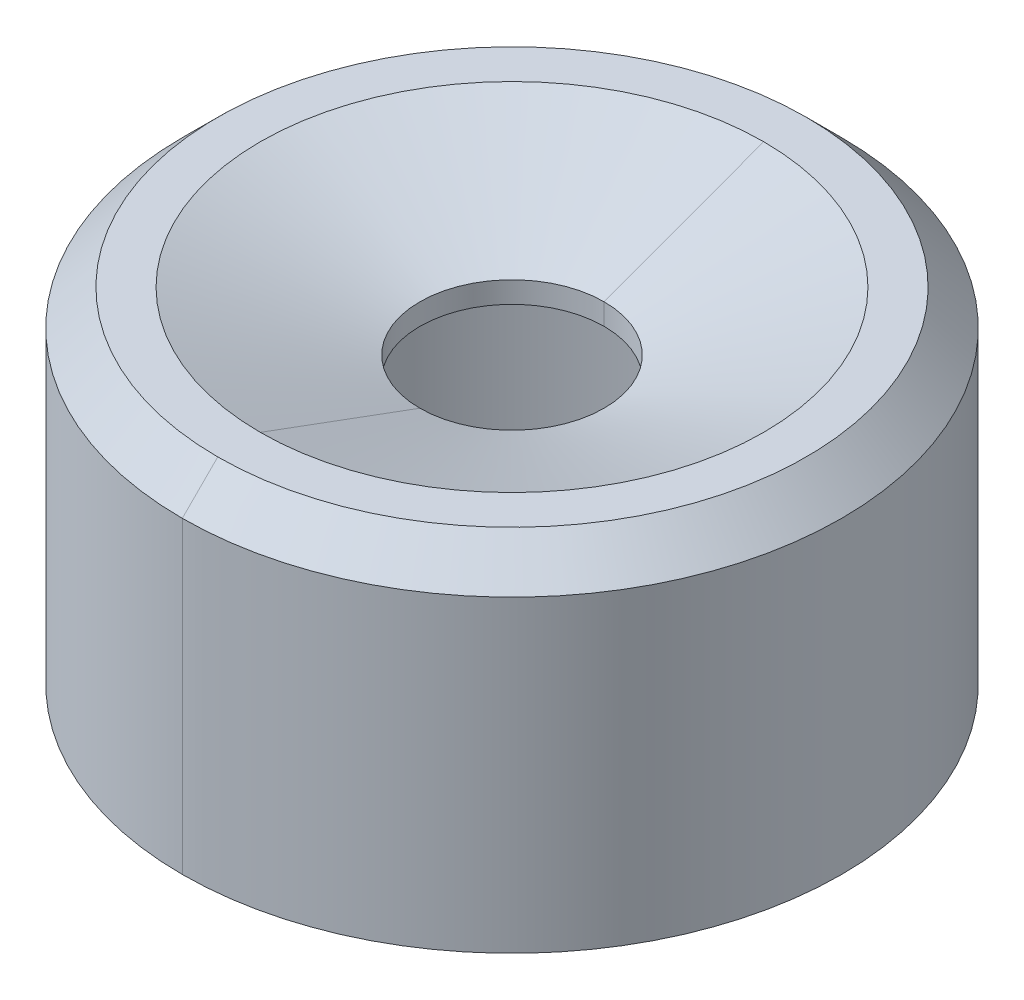
ISO-10303-21;
HEADER;
FILE_DESCRIPTION(('STEP AP214'),'2;1');
FILE_NAME('part.step','',(''),(''),'','','');
FILE_SCHEMA(('AUTOMOTIVE_DESIGN { 1 0 10303 214 1 1 1 1 }'));
ENDSEC;
DATA;
#1=APPLICATION_CONTEXT('core data for automotive mechanical design processes');
#2=APPLICATION_PROTOCOL_DEFINITION('international standard','automotive_design',2000,#1);
#3=PRODUCT_CONTEXT('',#1,'mechanical');
#4=PRODUCT('Part','Part','',(#3));
#5=PRODUCT_RELATED_PRODUCT_CATEGORY('part','',(#4));
#6=PRODUCT_DEFINITION_FORMATION('','',#4);
#7=PRODUCT_DEFINITION_CONTEXT('part definition',#1,'design');
#8=PRODUCT_DEFINITION('design','',#6,#7);
#9=PRODUCT_DEFINITION_SHAPE('','',#8);
#10=(LENGTH_UNIT() NAMED_UNIT(*) SI_UNIT(.MILLI.,.METRE.));
#11=(NAMED_UNIT(*) PLANE_ANGLE_UNIT() SI_UNIT($,.RADIAN.));
#12=(NAMED_UNIT(*) SI_UNIT($,.STERADIAN.) SOLID_ANGLE_UNIT());
#13=UNCERTAINTY_MEASURE_WITH_UNIT(LENGTH_MEASURE(1.E-05),#10,'distance_accuracy_value','');
#14=(GEOMETRIC_REPRESENTATION_CONTEXT(3) GLOBAL_UNCERTAINTY_ASSIGNED_CONTEXT((#13)) GLOBAL_UNIT_ASSIGNED_CONTEXT((#10,
#11,#12)) REPRESENTATION_CONTEXT('',''));
#15=CARTESIAN_POINT('',(0.,0.,0.));
#16=DIRECTION('',(0.,0.,1.));
#17=DIRECTION('',(1.,0.,0.));
#18=AXIS2_PLACEMENT_3D('',#15,#16,#17);
#19=CARTESIAN_POINT('',(0.,48.18107344633,0.));
#20=DIRECTION('',(0.,1.,0.));
#21=DIRECTION('',(0.,0.,1.));
#22=AXIS2_PLACEMENT_3D('',#19,#20,#21);
#23=CYLINDRICAL_SURFACE('',#22,1.3);
#24=CARTESIAN_POINT('',(0.,3.72,0.));
#25=DIRECTION('',(0.,1.,0.));
#26=DIRECTION('',(0.,0.,1.));
#27=AXIS2_PLACEMENT_3D('',#24,#25,#26);
#28=CIRCLE('',#27,1.3);
#29=CARTESIAN_POINT('',(0.,3.72,1.3));
#30=VERTEX_POINT('',#29);
#31=CARTESIAN_POINT('',(0.,3.72,-1.3));
#32=VERTEX_POINT('',#31);
#33=EDGE_CURVE('E194',#30,#32,#28,.T.);
#34=ORIENTED_EDGE('',*,*,#33,.F.);
#35=DIRECTION('',(0.,-1.,0.));
#36=VECTOR('',#35,1.);
#37=CARTESIAN_POINT('',(0.,4.02,1.3));
#38=LINE('',#37,#36);
#39=CARTESIAN_POINT('',(0.,4.02,1.3));
#40=VERTEX_POINT('',#39);
#41=EDGE_CURVE('E177',#40,#30,#38,.T.);
#42=ORIENTED_EDGE('',*,*,#41,.F.);
#43=CARTESIAN_POINT('',(0.,4.02,0.));
#44=DIRECTION('',(0.,-1.,0.));
#45=DIRECTION('',(0.,0.,-1.));
#46=AXIS2_PLACEMENT_3D('',#43,#44,#45);
#47=CIRCLE('',#46,1.3);
#48=CARTESIAN_POINT('',(0.,4.02,-1.3));
#49=VERTEX_POINT('',#48);
#50=EDGE_CURVE('E147',#49,#40,#47,.T.);
#51=ORIENTED_EDGE('',*,*,#50,.F.);
#52=DIRECTION('',(0.,-1.,0.));
#53=VECTOR('',#52,1.);
#54=CARTESIAN_POINT('',(0.,4.02,-1.3));
#55=LINE('',#54,#53);
#56=EDGE_CURVE('E173',#49,#32,#55,.T.);
#57=ORIENTED_EDGE('',*,*,#56,.T.);
#58=EDGE_LOOP('',(#34,#42,#51,#57));
#59=FACE_BOUND('',#58,.T.);
#60=ADVANCED_FACE('F15',(#59),#23,.F.);
#61=CARTESIAN_POINT('',(0.,48.18107344633,0.));
#62=DIRECTION('',(0.,1.,0.));
#63=DIRECTION('',(0.,0.,1.));
#64=AXIS2_PLACEMENT_3D('',#61,#62,#63);
#65=CYLINDRICAL_SURFACE('',#64,4.145);
#66=CARTESIAN_POINT('',(0.,0.,0.));
#67=DIRECTION('',(0.,1.,0.));
#68=DIRECTION('',(0.,0.,1.));
#69=AXIS2_PLACEMENT_3D('',#66,#67,#68);
#70=CIRCLE('',#69,4.145);
#71=CARTESIAN_POINT('',(0.,0.,4.145));
#72=VERTEX_POINT('',#71);
#73=CARTESIAN_POINT('',(0.,0.,-4.145));
#74=VERTEX_POINT('',#73);
#75=EDGE_CURVE('E112',#72,#74,#70,.T.);
#76=ORIENTED_EDGE('',*,*,#75,.F.);
#77=DIRECTION('',(0.,-1.,0.));
#78=VECTOR('',#77,1.);
#79=CARTESIAN_POINT('',(0.,3.1,4.145));
#80=LINE('',#79,#78);
#81=CARTESIAN_POINT('',(0.,3.1,4.145));
#82=VERTEX_POINT('',#81);
#83=EDGE_CURVE('E116',#82,#72,#80,.T.);
#84=ORIENTED_EDGE('',*,*,#83,.F.);
#85=CARTESIAN_POINT('',(0.,3.1,0.));
#86=DIRECTION('',(0.,-1.,0.));
#87=DIRECTION('',(0.,0.,-1.));
#88=AXIS2_PLACEMENT_3D('',#85,#86,#87);
#89=CIRCLE('',#88,4.145);
#90=CARTESIAN_POINT('',(0.,3.1,-4.145));
#91=VERTEX_POINT('',#90);
#92=EDGE_CURVE('E10',#91,#82,#89,.T.);
#93=ORIENTED_EDGE('',*,*,#92,.F.);
#94=DIRECTION('',(0.,-1.,0.));
#95=VECTOR('',#94,1.);
#96=CARTESIAN_POINT('',(0.,3.1,-4.145));
#97=LINE('',#96,#95);
#98=EDGE_CURVE('E119',#91,#74,#97,.T.);
#99=ORIENTED_EDGE('',*,*,#98,.T.);
#100=EDGE_LOOP('',(#76,#84,#93,#99));
#101=FACE_BOUND('',#100,.T.);
#102=ADVANCED_FACE('F114',(#101),#65,.F.);
#103=CARTESIAN_POINT('',(0.,3.1,0.));
#104=DIRECTION('',(0.,1.,0.));
#105=DIRECTION('',(1.,0.,0.));
#106=AXIS2_PLACEMENT_3D('',#103,#104,#105);
#107=PLANE('',#106);
#108=CARTESIAN_POINT('',(0.,3.1,0.));
#109=DIRECTION('',(0.,1.,0.));
#110=DIRECTION('',(0.,0.,-1.));
#111=AXIS2_PLACEMENT_3D('',#108,#109,#110);
#112=CIRCLE('',#111,3.075);
#113=CARTESIAN_POINT('',(0.,3.1,-3.075));
#114=VERTEX_POINT('',#113);
#115=CARTESIAN_POINT('',(0.,3.1,3.075));
#116=VERTEX_POINT('',#115);
#117=EDGE_CURVE('E26',#114,#116,#112,.T.);
#118=ORIENTED_EDGE('',*,*,#117,.T.);
#119=CARTESIAN_POINT('',(0.,3.1,0.));
#120=DIRECTION('',(0.,1.,0.));
#121=DIRECTION('',(0.,0.,1.));
#122=AXIS2_PLACEMENT_3D('',#119,#120,#121);
#123=CIRCLE('',#122,3.075);
#124=EDGE_CURVE('E196',#116,#114,#123,.T.);
#125=ORIENTED_EDGE('',*,*,#124,.T.);
#126=EDGE_LOOP('',(#118,#125));
#127=FACE_BOUND('',#126,.T.);
#128=CARTESIAN_POINT('',(0.,3.1,0.));
#129=DIRECTION('',(0.,-1.,0.));
#130=DIRECTION('',(0.,0.,1.));
#131=AXIS2_PLACEMENT_3D('',#128,#129,#130);
#132=CIRCLE('',#131,4.145);
#133=EDGE_CURVE('E135',#82,#91,#132,.T.);
#134=ORIENTED_EDGE('',*,*,#133,.T.);
#135=ORIENTED_EDGE('',*,*,#92,.T.);
#136=EDGE_LOOP('',(#134,#135));
#137=FACE_BOUND('',#136,.T.);
#138=ADVANCED_FACE('F17',(#127,#137),#107,.F.);
#139=CARTESIAN_POINT('',(0.,48.18107344633,0.));
#140=DIRECTION('',(0.,1.,0.));
#141=DIRECTION('',(0.,0.,1.));
#142=AXIS2_PLACEMENT_3D('',#139,#140,#141);
#143=CYLINDRICAL_SURFACE('',#142,3.075);
#144=DIRECTION('',(0.,-1.,0.));
#145=VECTOR('',#144,1.);
#146=CARTESIAN_POINT('',(0.,3.72,-3.075));
#147=LINE('',#146,#145);
#148=CARTESIAN_POINT('',(0.,3.72,-3.075));
#149=VERTEX_POINT('',#148);
#150=EDGE_CURVE('E181',#149,#114,#147,.T.);
#151=ORIENTED_EDGE('',*,*,#150,.F.);
#152=CARTESIAN_POINT('',(0.,3.72,0.));
#153=DIRECTION('',(0.,-1.,0.));
#154=DIRECTION('',(0.,0.,1.));
#155=AXIS2_PLACEMENT_3D('',#152,#153,#154);
#156=CIRCLE('',#155,3.075);
#157=CARTESIAN_POINT('',(0.,3.72,3.075));
#158=VERTEX_POINT('',#157);
#159=EDGE_CURVE('E160',#158,#149,#156,.T.);
#160=ORIENTED_EDGE('',*,*,#159,.F.);
#161=DIRECTION('',(0.,-1.,0.));
#162=VECTOR('',#161,1.);
#163=CARTESIAN_POINT('',(0.,3.72,3.075));
#164=LINE('',#163,#162);
#165=EDGE_CURVE('E189',#158,#116,#164,.T.);
#166=ORIENTED_EDGE('',*,*,#165,.T.);
#167=ORIENTED_EDGE('',*,*,#117,.F.);
#168=EDGE_LOOP('',(#151,#160,#166,#167));
#169=FACE_BOUND('',#168,.T.);
#170=ADVANCED_FACE('F218',(#169),#143,.F.);
#171=CARTESIAN_POINT('',(0.,48.18107344633,0.));
#172=DIRECTION('',(0.,1.,0.));
#173=DIRECTION('',(0.,0.,1.));
#174=AXIS2_PLACEMENT_3D('',#171,#172,#173);
#175=CYLINDRICAL_SURFACE('',#174,3.075);
#176=ORIENTED_EDGE('',*,*,#124,.F.);
#177=ORIENTED_EDGE('',*,*,#165,.F.);
#178=CARTESIAN_POINT('',(0.,3.72,0.));
#179=DIRECTION('',(0.,-1.,0.));
#180=DIRECTION('',(0.,0.,-1.));
#181=AXIS2_PLACEMENT_3D('',#178,#179,#180);
#182=CIRCLE('',#181,3.075);
#183=EDGE_CURVE('E164',#149,#158,#182,.T.);
#184=ORIENTED_EDGE('',*,*,#183,.F.);
#185=ORIENTED_EDGE('',*,*,#150,.T.);
#186=EDGE_LOOP('',(#176,#177,#184,#185));
#187=FACE_BOUND('',#186,.T.);
#188=ADVANCED_FACE('F213',(#187),#175,.F.);
#189=CARTESIAN_POINT('',(0.,3.72,0.));
#190=DIRECTION('',(0.,1.,0.));
#191=DIRECTION('',(1.,0.,0.));
#192=AXIS2_PLACEMENT_3D('',#189,#190,#191);
#193=PLANE('',#192);
#194=CARTESIAN_POINT('',(0.,3.72,0.));
#195=DIRECTION('',(0.,1.,0.));
#196=DIRECTION('',(0.,0.,-1.));
#197=AXIS2_PLACEMENT_3D('',#194,#195,#196);
#198=CIRCLE('',#197,1.3);
#199=EDGE_CURVE('E165',#32,#30,#198,.T.);
#200=ORIENTED_EDGE('',*,*,#199,.T.);
#201=ORIENTED_EDGE('',*,*,#33,.T.);
#202=EDGE_LOOP('',(#200,#201));
#203=FACE_BOUND('',#202,.T.);
#204=ORIENTED_EDGE('',*,*,#159,.T.);
#205=ORIENTED_EDGE('',*,*,#183,.T.);
#206=EDGE_LOOP('',(#204,#205));
#207=FACE_BOUND('',#206,.T.);
#208=ADVANCED_FACE('F210',(#203,#207),#193,.F.);
#209=CARTESIAN_POINT('',(0.,48.18107344633,0.));
#210=DIRECTION('',(0.,1.,0.));
#211=DIRECTION('',(0.,0.,1.));
#212=AXIS2_PLACEMENT_3D('',#209,#210,#211);
#213=CYLINDRICAL_SURFACE('',#212,1.3);
#214=ORIENTED_EDGE('',*,*,#56,.F.);
#215=CARTESIAN_POINT('',(0.,4.02,0.));
#216=DIRECTION('',(0.,-1.,0.));
#217=DIRECTION('',(0.,0.,1.));
#218=AXIS2_PLACEMENT_3D('',#215,#216,#217);
#219=CIRCLE('',#218,1.3);
#220=EDGE_CURVE('E178',#40,#49,#219,.T.);
#221=ORIENTED_EDGE('',*,*,#220,.F.);
#222=ORIENTED_EDGE('',*,*,#41,.T.);
#223=ORIENTED_EDGE('',*,*,#199,.F.);
#224=EDGE_LOOP('',(#214,#221,#222,#223));
#225=FACE_BOUND('',#224,.T.);
#226=ADVANCED_FACE('F204',(#225),#213,.F.);
#227=CARTESIAN_POINT('',(0.,4.435,0.));
#228=DIRECTION('',(0.,1.,0.));
#229=DIRECTION('',(0.,0.,1.));
#230=AXIS2_PLACEMENT_3D('',#227,#228,#229);
#231=CONICAL_SURFACE('',#230,2.425,1.21739407737651);
#232=DIRECTION('',(0.,-0.346091796984605,0.938200654476412));
#233=VECTOR('',#232,1.);
#234=CARTESIAN_POINT('',(0.,4.85,-3.55));
#235=LINE('',#234,#233);
#236=CARTESIAN_POINT('',(0.,4.85,-3.55));
#237=VERTEX_POINT('',#236);
#238=EDGE_CURVE('E243',#237,#49,#235,.T.);
#239=ORIENTED_EDGE('',*,*,#238,.F.);
#240=CARTESIAN_POINT('',(0.,4.85,0.));
#241=DIRECTION('',(0.,-1.,0.));
#242=DIRECTION('',(0.,0.,1.));
#243=AXIS2_PLACEMENT_3D('',#240,#241,#242);
#244=CIRCLE('',#243,3.55);
#245=CARTESIAN_POINT('',(0.,4.85,3.55));
#246=VERTEX_POINT('',#245);
#247=EDGE_CURVE('E19',#246,#237,#244,.T.);
#248=ORIENTED_EDGE('',*,*,#247,.F.);
#249=DIRECTION('',(0.,-0.346091796984605,-0.938200654476412));
#250=VECTOR('',#249,1.);
#251=CARTESIAN_POINT('',(0.,4.85,3.55));
#252=LINE('',#251,#250);
#253=EDGE_CURVE('E151',#246,#40,#252,.T.);
#254=ORIENTED_EDGE('',*,*,#253,.T.);
#255=ORIENTED_EDGE('',*,*,#220,.T.);
#256=EDGE_LOOP('',(#239,#248,#254,#255));
#257=FACE_BOUND('',#256,.T.);
#258=ADVANCED_FACE('F273',(#257),#231,.F.);
#259=CARTESIAN_POINT('',(0.,4.435,0.));
#260=DIRECTION('',(0.,1.,0.));
#261=DIRECTION('',(0.,0.,1.));
#262=AXIS2_PLACEMENT_3D('',#259,#260,#261);
#263=CONICAL_SURFACE('',#262,2.425,1.21739407737651);
#264=ORIENTED_EDGE('',*,*,#50,.T.);
#265=ORIENTED_EDGE('',*,*,#253,.F.);
#266=CARTESIAN_POINT('',(0.,4.85,0.));
#267=DIRECTION('',(0.,-1.,0.));
#268=DIRECTION('',(0.,0.,-1.));
#269=AXIS2_PLACEMENT_3D('',#266,#267,#268);
#270=CIRCLE('',#269,3.55);
#271=EDGE_CURVE('E152',#237,#246,#270,.T.);
#272=ORIENTED_EDGE('',*,*,#271,.F.);
#273=ORIENTED_EDGE('',*,*,#238,.T.);
#274=EDGE_LOOP('',(#264,#265,#272,#273));
#275=FACE_BOUND('',#274,.T.);
#276=ADVANCED_FACE('F265',(#275),#263,.F.);
#277=CARTESIAN_POINT('',(0.,4.85,0.));
#278=DIRECTION('',(0.,-1.,0.));
#279=DIRECTION('',(0.,0.,-1.));
#280=AXIS2_PLACEMENT_3D('',#277,#278,#279);
#281=PLANE('',#280);
#282=ORIENTED_EDGE('',*,*,#247,.T.);
#283=ORIENTED_EDGE('',*,*,#271,.T.);
#284=EDGE_LOOP('',(#282,#283));
#285=FACE_BOUND('',#284,.T.);
#286=CARTESIAN_POINT('',(0.,4.85,0.));
#287=DIRECTION('',(0.,1.,0.));
#288=DIRECTION('',(0.,0.,1.));
#289=AXIS2_PLACEMENT_3D('',#286,#287,#288);
#290=CIRCLE('',#289,4.15);
#291=CARTESIAN_POINT('',(0.,4.85,4.15));
#292=VERTEX_POINT('',#291);
#293=CARTESIAN_POINT('',(0.,4.85,-4.15));
#294=VERTEX_POINT('',#293);
#295=EDGE_CURVE('E158',#292,#294,#290,.T.);
#296=ORIENTED_EDGE('',*,*,#295,.T.);
#297=CARTESIAN_POINT('',(0.,4.85,0.));
#298=DIRECTION('',(0.,1.,0.));
#299=DIRECTION('',(0.,0.,-1.));
#300=AXIS2_PLACEMENT_3D('',#297,#298,#299);
#301=CIRCLE('',#300,4.15);
#302=EDGE_CURVE('E166',#294,#292,#301,.T.);
#303=ORIENTED_EDGE('',*,*,#302,.T.);
#304=EDGE_LOOP('',(#296,#303));
#305=FACE_BOUND('',#304,.T.);
#306=ADVANCED_FACE('F263',(#285,#305),#281,.F.);
#307=CARTESIAN_POINT('',(0.,4.6,0.));
#308=DIRECTION('',(0.,-1.,0.));
#309=DIRECTION('',(0.,0.,-1.));
#310=AXIS2_PLACEMENT_3D('',#307,#308,#309);
#311=CONICAL_SURFACE('',#310,4.4,0.7853981633973);
#312=DIRECTION('',(0.,0.707106781186597,-0.707106781186498));
#313=VECTOR('',#312,1.);
#314=CARTESIAN_POINT('',(0.,4.35,4.65));
#315=LINE('',#314,#313);
#316=CARTESIAN_POINT('',(0.,4.35,4.65));
#317=VERTEX_POINT('',#316);
#318=EDGE_CURVE('E154',#317,#292,#315,.T.);
#319=ORIENTED_EDGE('',*,*,#318,.F.);
#320=CARTESIAN_POINT('',(0.,4.35,0.));
#321=DIRECTION('',(0.,1.,0.));
#322=DIRECTION('',(0.,0.,1.));
#323=AXIS2_PLACEMENT_3D('',#320,#321,#322);
#324=CIRCLE('',#323,4.65);
#325=CARTESIAN_POINT('',(0.,4.35,-4.65));
#326=VERTEX_POINT('',#325);
#327=EDGE_CURVE('E145',#317,#326,#324,.T.);
#328=ORIENTED_EDGE('',*,*,#327,.T.);
#329=DIRECTION('',(0.,0.707106781186597,0.707106781186498));
#330=VECTOR('',#329,1.);
#331=CARTESIAN_POINT('',(0.,4.35,-4.65));
#332=LINE('',#331,#330);
#333=EDGE_CURVE('E159',#326,#294,#332,.T.);
#334=ORIENTED_EDGE('',*,*,#333,.T.);
#335=ORIENTED_EDGE('',*,*,#295,.F.);
#336=EDGE_LOOP('',(#319,#328,#334,#335));
#337=FACE_BOUND('',#336,.T.);
#338=ADVANCED_FACE('F256',(#337),#311,.T.);
#339=CARTESIAN_POINT('',(0.,4.6,0.));
#340=DIRECTION('',(0.,-1.,0.));
#341=DIRECTION('',(0.,0.,-1.));
#342=AXIS2_PLACEMENT_3D('',#339,#340,#341);
#343=CONICAL_SURFACE('',#342,4.4,0.7853981633973);
#344=ORIENTED_EDGE('',*,*,#302,.F.);
#345=ORIENTED_EDGE('',*,*,#333,.F.);
#346=CARTESIAN_POINT('',(0.,4.35,0.));
#347=DIRECTION('',(0.,1.,0.));
#348=DIRECTION('',(0.,0.,-1.));
#349=AXIS2_PLACEMENT_3D('',#346,#347,#348);
#350=CIRCLE('',#349,4.65);
#351=EDGE_CURVE('E170',#326,#317,#350,.T.);
#352=ORIENTED_EDGE('',*,*,#351,.T.);
#353=ORIENTED_EDGE('',*,*,#318,.T.);
#354=EDGE_LOOP('',(#344,#345,#352,#353));
#355=FACE_BOUND('',#354,.T.);
#356=ADVANCED_FACE('F261',(#355),#343,.T.);
#357=CARTESIAN_POINT('',(0.,48.18107344633,0.));
#358=DIRECTION('',(0.,1.,0.));
#359=DIRECTION('',(0.,0.,1.));
#360=AXIS2_PLACEMENT_3D('',#357,#358,#359);
#361=CYLINDRICAL_SURFACE('',#360,4.65);
#362=CARTESIAN_POINT('',(0.,0.,0.));
#363=DIRECTION('',(0.,-1.,0.));
#364=DIRECTION('',(0.,0.,1.));
#365=AXIS2_PLACEMENT_3D('',#362,#363,#364);
#366=CIRCLE('',#365,4.65);
#367=CARTESIAN_POINT('',(0.,0.,4.65));
#368=VERTEX_POINT('',#367);
#369=CARTESIAN_POINT('',(0.,0.,-4.65));
#370=VERTEX_POINT('',#369);
#371=EDGE_CURVE('E131',#368,#370,#366,.T.);
#372=ORIENTED_EDGE('',*,*,#371,.F.);
#373=DIRECTION('',(0.,-1.,0.));
#374=VECTOR('',#373,1.);
#375=CARTESIAN_POINT('',(0.,4.35,4.65));
#376=LINE('',#375,#374);
#377=EDGE_CURVE('E229',#317,#368,#376,.T.);
#378=ORIENTED_EDGE('',*,*,#377,.F.);
#379=ORIENTED_EDGE('',*,*,#351,.F.);
#380=DIRECTION('',(0.,-1.,0.));
#381=VECTOR('',#380,1.);
#382=CARTESIAN_POINT('',(0.,4.35,-4.65));
#383=LINE('',#382,#381);
#384=EDGE_CURVE('E123',#326,#370,#383,.T.);
#385=ORIENTED_EDGE('',*,*,#384,.T.);
#386=EDGE_LOOP('',(#372,#378,#379,#385));
#387=FACE_BOUND('',#386,.T.);
#388=ADVANCED_FACE('F293',(#387),#361,.T.);
#389=CARTESIAN_POINT('',(0.,48.18107344633,0.));
#390=DIRECTION('',(0.,1.,0.));
#391=DIRECTION('',(0.,0.,1.));
#392=AXIS2_PLACEMENT_3D('',#389,#390,#391);
#393=CYLINDRICAL_SURFACE('',#392,4.65);
#394=ORIENTED_EDGE('',*,*,#384,.F.);
#395=ORIENTED_EDGE('',*,*,#327,.F.);
#396=ORIENTED_EDGE('',*,*,#377,.T.);
#397=CARTESIAN_POINT('',(0.,0.,0.));
#398=DIRECTION('',(0.,-1.,0.));
#399=DIRECTION('',(0.,0.,-1.));
#400=AXIS2_PLACEMENT_3D('',#397,#398,#399);
#401=CIRCLE('',#400,4.65);
#402=EDGE_CURVE('E124',#370,#368,#401,.T.);
#403=ORIENTED_EDGE('',*,*,#402,.F.);
#404=EDGE_LOOP('',(#394,#395,#396,#403));
#405=FACE_BOUND('',#404,.T.);
#406=ADVANCED_FACE('F290',(#405),#393,.T.);
#407=CARTESIAN_POINT('',(0.,0.,0.));
#408=DIRECTION('',(0.,1.,0.));
#409=DIRECTION('',(1.,0.,0.));
#410=AXIS2_PLACEMENT_3D('',#407,#408,#409);
#411=PLANE('',#410);
#412=CARTESIAN_POINT('',(0.,0.,0.));
#413=DIRECTION('',(0.,1.,0.));
#414=DIRECTION('',(0.,0.,-1.));
#415=AXIS2_PLACEMENT_3D('',#412,#413,#414);
#416=CIRCLE('',#415,4.145);
#417=EDGE_CURVE('E126',#74,#72,#416,.T.);
#418=ORIENTED_EDGE('',*,*,#417,.T.);
#419=ORIENTED_EDGE('',*,*,#75,.T.);
#420=EDGE_LOOP('',(#418,#419));
#421=FACE_BOUND('',#420,.T.);
#422=ORIENTED_EDGE('',*,*,#371,.T.);
#423=ORIENTED_EDGE('',*,*,#402,.T.);
#424=EDGE_LOOP('',(#422,#423));
#425=FACE_BOUND('',#424,.T.);
#426=ADVANCED_FACE('F127',(#421,#425),#411,.F.);
#427=CARTESIAN_POINT('',(0.,48.18107344633,0.));
#428=DIRECTION('',(0.,1.,0.));
#429=DIRECTION('',(0.,0.,1.));
#430=AXIS2_PLACEMENT_3D('',#427,#428,#429);
#431=CYLINDRICAL_SURFACE('',#430,4.145);
#432=ORIENTED_EDGE('',*,*,#98,.F.);
#433=ORIENTED_EDGE('',*,*,#133,.F.);
#434=ORIENTED_EDGE('',*,*,#83,.T.);
#435=ORIENTED_EDGE('',*,*,#417,.F.);
#436=EDGE_LOOP('',(#432,#433,#434,#435));
#437=FACE_BOUND('',#436,.T.);
#438=ADVANCED_FACE('F133',(#437),#431,.F.);
#439=CLOSED_SHELL('',(#60,#102,#138,#170,#188,#208,#226,#258,#276,#306,#338,#356,#388,#406,#426,#438));
#440=MANIFOLD_SOLID_BREP('B1',#439);
#441=ADVANCED_BREP_SHAPE_REPRESENTATION('',(#18,#440),#14);
#442=SHAPE_DEFINITION_REPRESENTATION(#9,#441);
ENDSEC;
END-ISO-10303-21;
